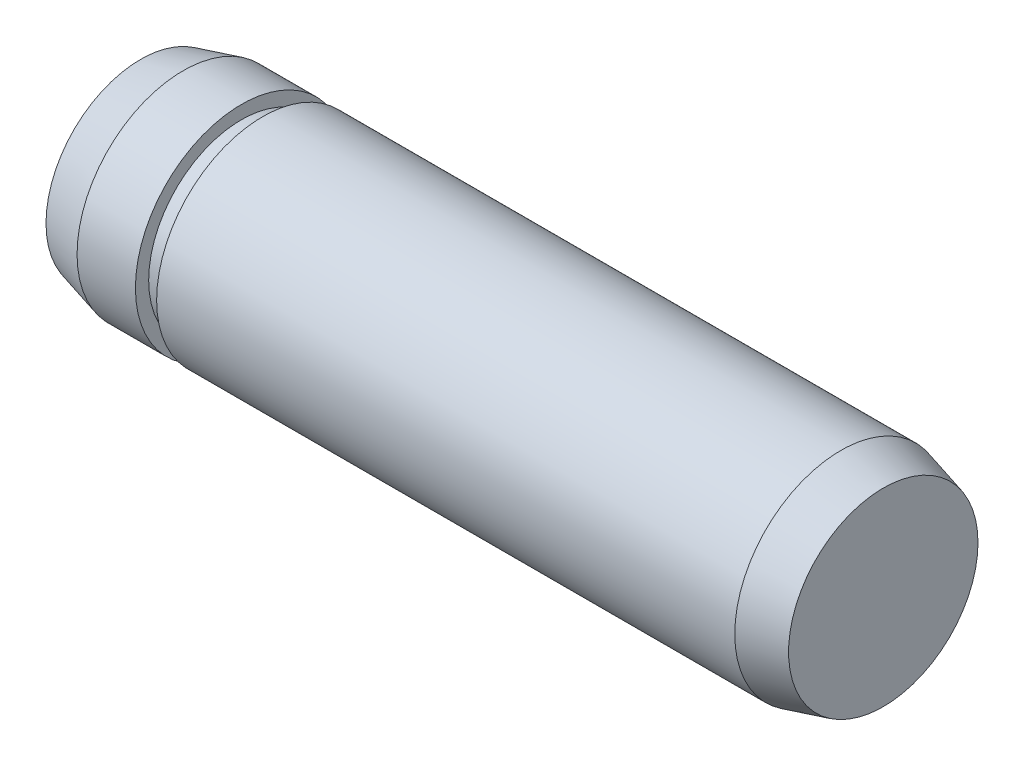
ISO-10303-21;
HEADER;
FILE_DESCRIPTION(('STEP AP214'),'2;1');
FILE_NAME('part.step','',(''),(''),'','','');
FILE_SCHEMA(('AUTOMOTIVE_DESIGN { 1 0 10303 214 1 1 1 1 }'));
ENDSEC;
DATA;
#1=APPLICATION_CONTEXT('core data for automotive mechanical design processes');
#2=APPLICATION_PROTOCOL_DEFINITION('international standard','automotive_design',2000,#1);
#3=PRODUCT_CONTEXT('',#1,'mechanical');
#4=PRODUCT('Part','Part','',(#3));
#5=PRODUCT_RELATED_PRODUCT_CATEGORY('part','',(#4));
#6=PRODUCT_DEFINITION_FORMATION('','',#4);
#7=PRODUCT_DEFINITION_CONTEXT('part definition',#1,'design');
#8=PRODUCT_DEFINITION('design','',#6,#7);
#9=PRODUCT_DEFINITION_SHAPE('','',#8);
#10=(LENGTH_UNIT() NAMED_UNIT(*) SI_UNIT(.MILLI.,.METRE.));
#11=(NAMED_UNIT(*) PLANE_ANGLE_UNIT() SI_UNIT($,.RADIAN.));
#12=(NAMED_UNIT(*) SI_UNIT($,.STERADIAN.) SOLID_ANGLE_UNIT());
#13=UNCERTAINTY_MEASURE_WITH_UNIT(LENGTH_MEASURE(1.E-05),#10,'distance_accuracy_value','');
#14=(GEOMETRIC_REPRESENTATION_CONTEXT(3) GLOBAL_UNCERTAINTY_ASSIGNED_CONTEXT((#13)) GLOBAL_UNIT_ASSIGNED_CONTEXT((#10,
#11,#12)) REPRESENTATION_CONTEXT('',''));
#15=CARTESIAN_POINT('',(0.,0.,0.));
#16=DIRECTION('',(0.,0.,1.));
#17=DIRECTION('',(1.,0.,0.));
#18=AXIS2_PLACEMENT_3D('',#15,#16,#17);
#19=CARTESIAN_POINT('',(-12.4,0.,0.));
#20=DIRECTION('',(1.,0.,0.));
#21=DIRECTION('',(0.,0.,-1.));
#22=AXIS2_PLACEMENT_3D('',#19,#20,#21);
#23=CYLINDRICAL_SURFACE('',#22,4.);
#24=CARTESIAN_POINT('',(-10.20000006,0.,0.));
#25=DIRECTION('',(-1.,0.,0.));
#26=DIRECTION('',(0.,0.,1.));
#27=AXIS2_PLACEMENT_3D('',#24,#25,#26);
#28=CIRCLE('',#27,4.);
#29=CARTESIAN_POINT('',(-10.20000006,0.,4.));
#30=VERTEX_POINT('',#29);
#31=EDGE_CURVE('E60',#30,#30,#28,.T.);
#32=ORIENTED_EDGE('',*,*,#31,.T.);
#33=EDGE_LOOP('',(#32));
#34=FACE_BOUND('',#33,.T.);
#35=CARTESIAN_POINT('',(-12.4,0.,0.));
#36=DIRECTION('',(-1.,0.,0.));
#37=DIRECTION('',(0.,0.,1.));
#38=AXIS2_PLACEMENT_3D('',#35,#36,#37);
#39=CIRCLE('',#38,4.);
#40=CARTESIAN_POINT('',(-12.4,0.,4.));
#41=VERTEX_POINT('',#40);
#42=EDGE_CURVE('E54',#41,#41,#39,.T.);
#43=ORIENTED_EDGE('',*,*,#42,.F.);
#44=EDGE_LOOP('',(#43));
#45=FACE_BOUND('',#44,.T.);
#46=ADVANCED_FACE('F37',(#34,#45),#23,.T.);
#47=CARTESIAN_POINT('',(-12.4,0.,0.));
#48=DIRECTION('',(1.,0.,0.));
#49=DIRECTION('',(0.,0.,1.));
#50=AXIS2_PLACEMENT_3D('',#47,#48,#49);
#51=CONICAL_SURFACE('',#50,4.,0.26179938779915);
#52=CARTESIAN_POINT('',(-14.,0.,0.));
#53=DIRECTION('',(-1.,0.,0.));
#54=DIRECTION('',(0.,0.,1.));
#55=AXIS2_PLACEMENT_3D('',#52,#53,#54);
#56=CIRCLE('',#55,3.5712812921102);
#57=CARTESIAN_POINT('',(-14.,0.,3.5712812921102));
#58=VERTEX_POINT('',#57);
#59=EDGE_CURVE('E49',#58,#58,#56,.T.);
#60=ORIENTED_EDGE('',*,*,#59,.F.);
#61=EDGE_LOOP('',(#60));
#62=FACE_BOUND('',#61,.T.);
#63=ORIENTED_EDGE('',*,*,#42,.T.);
#64=EDGE_LOOP('',(#63));
#65=FACE_BOUND('',#64,.T.);
#66=ADVANCED_FACE('F98',(#62,#65),#51,.T.);
#67=CARTESIAN_POINT('',(-14.,0.,0.));
#68=DIRECTION('',(-1.,0.,0.));
#69=DIRECTION('',(0.,0.,1.));
#70=AXIS2_PLACEMENT_3D('',#67,#68,#69);
#71=PLANE('',#70);
#72=ORIENTED_EDGE('',*,*,#59,.T.);
#73=EDGE_LOOP('',(#72));
#74=FACE_BOUND('',#73,.T.);
#75=ADVANCED_FACE('F93',(#74),#71,.T.);
#76=CARTESIAN_POINT('',(-10.20000006,0.,0.));
#77=DIRECTION('',(-1.,0.,0.));
#78=DIRECTION('',(0.,0.,1.));
#79=AXIS2_PLACEMENT_3D('',#76,#77,#78);
#80=PLANE('',#79);
#81=ORIENTED_EDGE('',*,*,#31,.F.);
#82=EDGE_LOOP('',(#81));
#83=FACE_BOUND('',#82,.T.);
#84=CARTESIAN_POINT('',(-10.20000006,0.,0.));
#85=DIRECTION('',(-1.,0.,0.));
#86=DIRECTION('',(0.,0.,1.));
#87=AXIS2_PLACEMENT_3D('',#84,#85,#86);
#88=CIRCLE('',#87,3.5);
#89=CARTESIAN_POINT('',(-10.20000006,0.,3.5));
#90=VERTEX_POINT('',#89);
#91=EDGE_CURVE('E65',#90,#90,#88,.T.);
#92=ORIENTED_EDGE('',*,*,#91,.T.);
#93=EDGE_LOOP('',(#92));
#94=FACE_BOUND('',#93,.T.);
#95=ADVANCED_FACE('F77',(#83,#94),#80,.F.);
#96=CARTESIAN_POINT('',(-9.40000006,0.,0.));
#97=DIRECTION('',(-1.,0.,0.));
#98=DIRECTION('',(0.,0.,1.));
#99=AXIS2_PLACEMENT_3D('',#96,#97,#98);
#100=PLANE('',#99);
#101=CARTESIAN_POINT('',(-9.40000006,0.,0.));
#102=DIRECTION('',(-1.,0.,0.));
#103=DIRECTION('',(0.,0.,1.));
#104=AXIS2_PLACEMENT_3D('',#101,#102,#103);
#105=CIRCLE('',#104,4.);
#106=CARTESIAN_POINT('',(-9.40000006,0.,4.));
#107=VERTEX_POINT('',#106);
#108=EDGE_CURVE('E61',#107,#107,#105,.T.);
#109=ORIENTED_EDGE('',*,*,#108,.T.);
#110=EDGE_LOOP('',(#109));
#111=FACE_BOUND('',#110,.T.);
#112=CARTESIAN_POINT('',(-9.40000006,0.,0.));
#113=DIRECTION('',(-1.,0.,0.));
#114=DIRECTION('',(0.,0.,1.));
#115=AXIS2_PLACEMENT_3D('',#112,#113,#114);
#116=CIRCLE('',#115,3.5);
#117=CARTESIAN_POINT('',(-9.40000006,0.,3.5));
#118=VERTEX_POINT('',#117);
#119=EDGE_CURVE('E69',#118,#118,#116,.T.);
#120=ORIENTED_EDGE('',*,*,#119,.F.);
#121=EDGE_LOOP('',(#120));
#122=FACE_BOUND('',#121,.T.);
#123=ADVANCED_FACE('F83',(#111,#122),#100,.T.);
#124=CARTESIAN_POINT('',(-10.20000006,0.,0.));
#125=DIRECTION('',(1.,0.,0.));
#126=DIRECTION('',(0.,0.,-1.));
#127=AXIS2_PLACEMENT_3D('',#124,#125,#126);
#128=CYLINDRICAL_SURFACE('',#127,3.5);
#129=ORIENTED_EDGE('',*,*,#91,.F.);
#130=EDGE_LOOP('',(#129));
#131=FACE_BOUND('',#130,.T.);
#132=ORIENTED_EDGE('',*,*,#119,.T.);
#133=EDGE_LOOP('',(#132));
#134=FACE_BOUND('',#133,.T.);
#135=ADVANCED_FACE('F79',(#131,#134),#128,.T.);
#136=CARTESIAN_POINT('',(14.,0.,0.));
#137=DIRECTION('',(1.,0.,0.));
#138=DIRECTION('',(0.,0.,-1.));
#139=AXIS2_PLACEMENT_3D('',#136,#137,#138);
#140=PLANE('',#139);
#141=CARTESIAN_POINT('',(14.,0.,0.));
#142=DIRECTION('',(1.,0.,0.));
#143=DIRECTION('',(0.,0.,-1.));
#144=AXIS2_PLACEMENT_3D('',#141,#142,#143);
#145=CIRCLE('',#144,3.5712812921102);
#146=CARTESIAN_POINT('',(14.,0.,-3.5712812921102));
#147=VERTEX_POINT('',#146);
#148=EDGE_CURVE('E44',#147,#147,#145,.T.);
#149=ORIENTED_EDGE('',*,*,#148,.T.);
#150=EDGE_LOOP('',(#149));
#151=FACE_BOUND('',#150,.T.);
#152=ADVANCED_FACE('F82',(#151),#140,.T.);
#153=CARTESIAN_POINT('',(12.4,0.,0.));
#154=DIRECTION('',(-1.,0.,0.));
#155=DIRECTION('',(0.,0.,-1.));
#156=AXIS2_PLACEMENT_3D('',#153,#154,#155);
#157=CONICAL_SURFACE('',#156,4.,0.26179938779915);
#158=ORIENTED_EDGE('',*,*,#148,.F.);
#159=EDGE_LOOP('',(#158));
#160=FACE_BOUND('',#159,.T.);
#161=CARTESIAN_POINT('',(12.4,0.,0.));
#162=DIRECTION('',(1.,0.,0.));
#163=DIRECTION('',(0.,0.,-1.));
#164=AXIS2_PLACEMENT_3D('',#161,#162,#163);
#165=CIRCLE('',#164,4.);
#166=CARTESIAN_POINT('',(12.4,0.,-4.));
#167=VERTEX_POINT('',#166);
#168=EDGE_CURVE('E10',#167,#167,#165,.T.);
#169=ORIENTED_EDGE('',*,*,#168,.T.);
#170=EDGE_LOOP('',(#169));
#171=FACE_BOUND('',#170,.T.);
#172=ADVANCED_FACE('F110',(#160,#171),#157,.T.);
#173=ORIENTED_EDGE('',*,*,#168,.F.);
#174=EDGE_LOOP('',(#173));
#175=FACE_BOUND('',#174,.T.);
#176=ORIENTED_EDGE('',*,*,#108,.F.);
#177=EDGE_LOOP('',(#176));
#178=FACE_BOUND('',#177,.T.);
#179=ADVANCED_FACE('F100',(#175,#178),#23,.T.);
#180=CLOSED_SHELL('',(#46,#66,#75,#95,#123,#135,#152,#172,#179));
#181=MANIFOLD_SOLID_BREP('B2',#180);
#182=ADVANCED_BREP_SHAPE_REPRESENTATION('',(#18,#181),#14);
#183=SHAPE_DEFINITION_REPRESENTATION(#9,#182);
ENDSEC;
END-ISO-10303-21;
